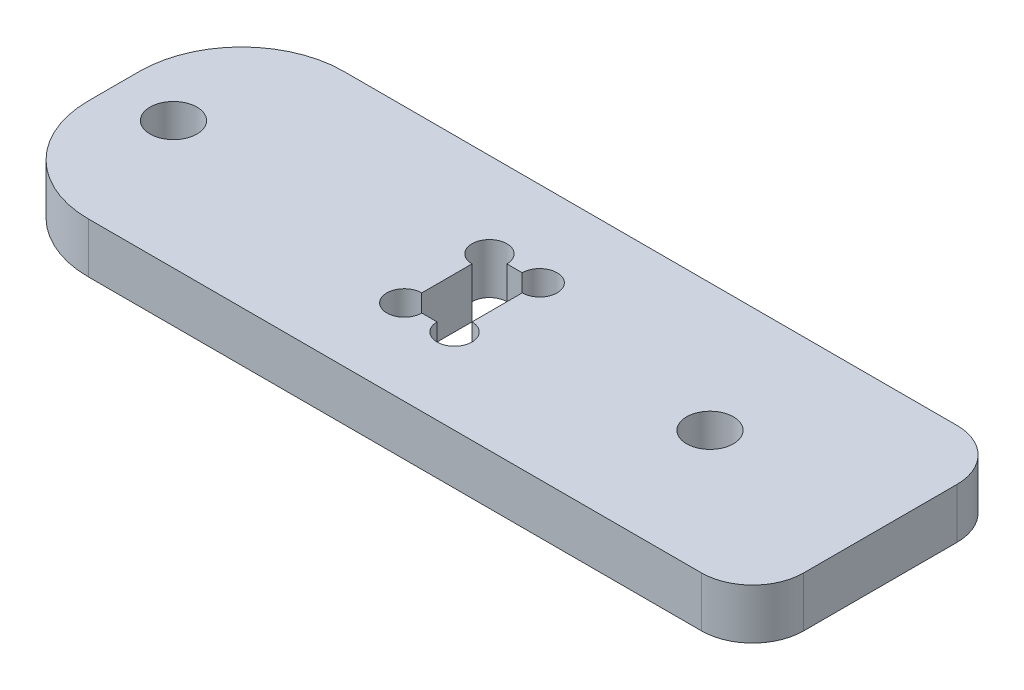
ISO-10303-21;
HEADER;
FILE_DESCRIPTION(('STEP AP214'),'2;1');
FILE_NAME('part.step','',(''),(''),'','','');
FILE_SCHEMA(('AUTOMOTIVE_DESIGN { 1 0 10303 214 1 1 1 1 }'));
ENDSEC;
DATA;
#1=APPLICATION_CONTEXT('core data for automotive mechanical design processes');
#2=APPLICATION_PROTOCOL_DEFINITION('international standard','automotive_design',2000,#1);
#3=PRODUCT_CONTEXT('',#1,'mechanical');
#4=PRODUCT('Part','Part','',(#3));
#5=PRODUCT_RELATED_PRODUCT_CATEGORY('part','',(#4));
#6=PRODUCT_DEFINITION_FORMATION('','',#4);
#7=PRODUCT_DEFINITION_CONTEXT('part definition',#1,'design');
#8=PRODUCT_DEFINITION('design','',#6,#7);
#9=PRODUCT_DEFINITION_SHAPE('','',#8);
#10=(LENGTH_UNIT() NAMED_UNIT(*) SI_UNIT(.MILLI.,.METRE.));
#11=(NAMED_UNIT(*) PLANE_ANGLE_UNIT() SI_UNIT($,.RADIAN.));
#12=(NAMED_UNIT(*) SI_UNIT($,.STERADIAN.) SOLID_ANGLE_UNIT());
#13=UNCERTAINTY_MEASURE_WITH_UNIT(LENGTH_MEASURE(1.E-05),#10,'distance_accuracy_value','');
#14=(GEOMETRIC_REPRESENTATION_CONTEXT(3) GLOBAL_UNCERTAINTY_ASSIGNED_CONTEXT((#13)) GLOBAL_UNIT_ASSIGNED_CONTEXT((#10,
#11,#12)) REPRESENTATION_CONTEXT('',''));
#15=CARTESIAN_POINT('',(0.,0.,0.));
#16=DIRECTION('',(0.,0.,1.));
#17=DIRECTION('',(1.,0.,0.));
#18=AXIS2_PLACEMENT_3D('',#15,#16,#17);
#19=CARTESIAN_POINT('',(45.,5.9,15.));
#20=DIRECTION('',(-1.,0.,0.));
#21=DIRECTION('',(0.,0.,1.));
#22=AXIS2_PLACEMENT_3D('',#19,#20,#21);
#23=PLANE('',#22);
#24=DIRECTION('',(0.,0.,-1.));
#25=VECTOR('',#24,1.);
#26=CARTESIAN_POINT('',(45.,0.,15.));
#27=LINE('',#26,#25);
#28=CARTESIAN_POINT('',(45.,0.,9.));
#29=VERTEX_POINT('',#28);
#30=CARTESIAN_POINT('',(45.,0.,-9.));
#31=VERTEX_POINT('',#30);
#32=EDGE_CURVE('E235',#29,#31,#27,.T.);
#33=ORIENTED_EDGE('',*,*,#32,.T.);
#34=DIRECTION('',(0.,-1.,0.));
#35=VECTOR('',#34,1.);
#36=CARTESIAN_POINT('',(45.,5.9,-9.));
#37=LINE('',#36,#35);
#38=CARTESIAN_POINT('',(45.,5.9,-9.));
#39=VERTEX_POINT('',#38);
#40=EDGE_CURVE('E202',#31,#39,#37,.F.);
#41=ORIENTED_EDGE('',*,*,#40,.T.);
#42=DIRECTION('',(0.,0.,-1.));
#43=VECTOR('',#42,1.);
#44=CARTESIAN_POINT('',(45.,5.9,15.));
#45=LINE('',#44,#43);
#46=CARTESIAN_POINT('',(45.,5.9,9.));
#47=VERTEX_POINT('',#46);
#48=EDGE_CURVE('E233',#47,#39,#45,.T.);
#49=ORIENTED_EDGE('',*,*,#48,.F.);
#50=DIRECTION('',(0.,-1.,0.));
#51=VECTOR('',#50,1.);
#52=CARTESIAN_POINT('',(45.,5.9,9.));
#53=LINE('',#52,#51);
#54=EDGE_CURVE('E199',#47,#29,#53,.T.);
#55=ORIENTED_EDGE('',*,*,#54,.T.);
#56=EDGE_LOOP('',(#33,#41,#49,#55));
#57=FACE_BOUND('',#56,.T.);
#58=ADVANCED_FACE('F38',(#57),#23,.F.);
#59=CARTESIAN_POINT('',(-45.,5.9,-15.));
#60=DIRECTION('',(0.,0.,1.));
#61=DIRECTION('',(1.,0.,0.));
#62=AXIS2_PLACEMENT_3D('',#59,#60,#61);
#63=PLANE('',#62);
#64=DIRECTION('',(-1.,0.,0.));
#65=VECTOR('',#64,1.);
#66=CARTESIAN_POINT('',(-45.,5.9,-15.));
#67=LINE('',#66,#65);
#68=CARTESIAN_POINT('',(39.,5.9,-15.));
#69=VERTEX_POINT('',#68);
#70=CARTESIAN_POINT('',(-33.,5.9,-15.));
#71=VERTEX_POINT('',#70);
#72=EDGE_CURVE('E253',#69,#71,#67,.T.);
#73=ORIENTED_EDGE('',*,*,#72,.F.);
#74=DIRECTION('',(0.,-1.,0.));
#75=VECTOR('',#74,1.);
#76=CARTESIAN_POINT('',(39.,5.9,-15.));
#77=LINE('',#76,#75);
#78=CARTESIAN_POINT('',(39.,0.,-15.));
#79=VERTEX_POINT('',#78);
#80=EDGE_CURVE('E188',#69,#79,#77,.T.);
#81=ORIENTED_EDGE('',*,*,#80,.T.);
#82=DIRECTION('',(-1.,0.,0.));
#83=VECTOR('',#82,1.);
#84=CARTESIAN_POINT('',(-45.,0.,-15.));
#85=LINE('',#84,#83);
#86=CARTESIAN_POINT('',(-33.,0.,-15.));
#87=VERTEX_POINT('',#86);
#88=EDGE_CURVE('E231',#79,#87,#85,.T.);
#89=ORIENTED_EDGE('',*,*,#88,.T.);
#90=DIRECTION('',(0.,-1.,0.));
#91=VECTOR('',#90,1.);
#92=CARTESIAN_POINT('',(-33.,5.9,-15.));
#93=LINE('',#92,#91);
#94=EDGE_CURVE('E181',#87,#71,#93,.F.);
#95=ORIENTED_EDGE('',*,*,#94,.T.);
#96=EDGE_LOOP('',(#73,#81,#89,#95));
#97=FACE_BOUND('',#96,.T.);
#98=ADVANCED_FACE('F271',(#97),#63,.F.);
#99=CARTESIAN_POINT('',(-45.,5.9,15.));
#100=DIRECTION('',(1.,0.,0.));
#101=DIRECTION('',(0.,0.,-1.));
#102=AXIS2_PLACEMENT_3D('',#99,#100,#101);
#103=PLANE('',#102);
#104=DIRECTION('',(0.,0.,1.));
#105=VECTOR('',#104,1.);
#106=CARTESIAN_POINT('',(-45.,0.,15.));
#107=LINE('',#106,#105);
#108=CARTESIAN_POINT('',(-45.,0.,-3.));
#109=VERTEX_POINT('',#108);
#110=CARTESIAN_POINT('',(-45.,0.,3.));
#111=VERTEX_POINT('',#110);
#112=EDGE_CURVE('E221',#109,#111,#107,.T.);
#113=ORIENTED_EDGE('',*,*,#112,.T.);
#114=DIRECTION('',(0.,-1.,0.));
#115=VECTOR('',#114,1.);
#116=CARTESIAN_POINT('',(-45.,5.9,3.));
#117=LINE('',#116,#115);
#118=CARTESIAN_POINT('',(-45.,5.9,3.));
#119=VERTEX_POINT('',#118);
#120=EDGE_CURVE('E12',#111,#119,#117,.F.);
#121=ORIENTED_EDGE('',*,*,#120,.T.);
#122=DIRECTION('',(0.,0.,1.));
#123=VECTOR('',#122,1.);
#124=CARTESIAN_POINT('',(-45.,5.9,15.));
#125=LINE('',#124,#123);
#126=CARTESIAN_POINT('',(-45.,5.9,-3.));
#127=VERTEX_POINT('',#126);
#128=EDGE_CURVE('E223',#127,#119,#125,.T.);
#129=ORIENTED_EDGE('',*,*,#128,.F.);
#130=DIRECTION('',(0.,-1.,0.));
#131=VECTOR('',#130,1.);
#132=CARTESIAN_POINT('',(-45.,5.9,-3.));
#133=LINE('',#132,#131);
#134=EDGE_CURVE('E46',#127,#109,#133,.T.);
#135=ORIENTED_EDGE('',*,*,#134,.T.);
#136=EDGE_LOOP('',(#113,#121,#129,#135));
#137=FACE_BOUND('',#136,.T.);
#138=ADVANCED_FACE('F220',(#137),#103,.F.);
#139=CARTESIAN_POINT('',(-45.,5.9,15.));
#140=DIRECTION('',(0.,0.,-1.));
#141=DIRECTION('',(-1.,0.,0.));
#142=AXIS2_PLACEMENT_3D('',#139,#140,#141);
#143=PLANE('',#142);
#144=DIRECTION('',(1.,0.,0.));
#145=VECTOR('',#144,1.);
#146=CARTESIAN_POINT('',(-45.,0.,15.));
#147=LINE('',#146,#145);
#148=CARTESIAN_POINT('',(-33.,0.,15.));
#149=VERTEX_POINT('',#148);
#150=CARTESIAN_POINT('',(39.,0.,15.));
#151=VERTEX_POINT('',#150);
#152=EDGE_CURVE('E230',#149,#151,#147,.T.);
#153=ORIENTED_EDGE('',*,*,#152,.T.);
#154=DIRECTION('',(0.,-1.,0.));
#155=VECTOR('',#154,1.);
#156=CARTESIAN_POINT('',(39.,5.9,15.));
#157=LINE('',#156,#155);
#158=CARTESIAN_POINT('',(39.,5.9,15.));
#159=VERTEX_POINT('',#158);
#160=EDGE_CURVE('E53',#151,#159,#157,.F.);
#161=ORIENTED_EDGE('',*,*,#160,.T.);
#162=DIRECTION('',(1.,0.,0.));
#163=VECTOR('',#162,1.);
#164=CARTESIAN_POINT('',(-45.,5.9,15.));
#165=LINE('',#164,#163);
#166=CARTESIAN_POINT('',(-33.,5.9,15.));
#167=VERTEX_POINT('',#166);
#168=EDGE_CURVE('E246',#167,#159,#165,.T.);
#169=ORIENTED_EDGE('',*,*,#168,.F.);
#170=DIRECTION('',(0.,-1.,0.));
#171=VECTOR('',#170,1.);
#172=CARTESIAN_POINT('',(-33.,5.9,15.));
#173=LINE('',#172,#171);
#174=EDGE_CURVE('E211',#167,#149,#173,.T.);
#175=ORIENTED_EDGE('',*,*,#174,.T.);
#176=EDGE_LOOP('',(#153,#161,#169,#175));
#177=FACE_BOUND('',#176,.T.);
#178=ADVANCED_FACE('F367',(#177),#143,.F.);
#179=CARTESIAN_POINT('',(0.,5.9,0.));
#180=DIRECTION('',(0.,-1.,0.));
#181=DIRECTION('',(0.,0.,-1.));
#182=AXIS2_PLACEMENT_3D('',#179,#180,#181);
#183=PLANE('',#182);
#184=DIRECTION('',(0.,0.,1.));
#185=VECTOR('',#184,1.);
#186=CARTESIAN_POINT('',(-5.9,5.9,-5.));
#187=LINE('',#186,#185);
#188=CARTESIAN_POINT('',(-5.9,5.9,-2.95));
#189=VERTEX_POINT('',#188);
#190=CARTESIAN_POINT('',(-5.9,5.9,2.95));
#191=VERTEX_POINT('',#190);
#192=EDGE_CURVE('E282',#189,#191,#187,.T.);
#193=ORIENTED_EDGE('',*,*,#192,.F.);
#194=CARTESIAN_POINT('',(-5.9,5.9,-5.));
#195=DIRECTION('',(0.,1.,0.));
#196=DIRECTION('',(0.,0.,1.));
#197=AXIS2_PLACEMENT_3D('',#194,#195,#196);
#198=CIRCLE('',#197,2.05);
#199=CARTESIAN_POINT('',(-3.85,5.9,-5.));
#200=VERTEX_POINT('',#199);
#201=EDGE_CURVE('E312',#200,#189,#198,.T.);
#202=ORIENTED_EDGE('',*,*,#201,.F.);
#203=DIRECTION('',(-1.,0.,0.));
#204=VECTOR('',#203,1.);
#205=CARTESIAN_POINT('',(-5.9,5.9,-5.));
#206=LINE('',#205,#204);
#207=CARTESIAN_POINT('',(-2.05,5.9,-5.));
#208=VERTEX_POINT('',#207);
#209=EDGE_CURVE('E285',#208,#200,#206,.T.);
#210=ORIENTED_EDGE('',*,*,#209,.F.);
#211=CARTESIAN_POINT('',(0.,5.9,-5.));
#212=DIRECTION('',(0.,1.,0.));
#213=DIRECTION('',(0.,0.,1.));
#214=AXIS2_PLACEMENT_3D('',#211,#212,#213);
#215=CIRCLE('',#214,2.05);
#216=CARTESIAN_POINT('',(0.,5.9,-2.95));
#217=VERTEX_POINT('',#216);
#218=EDGE_CURVE('E294',#217,#208,#215,.T.);
#219=ORIENTED_EDGE('',*,*,#218,.F.);
#220=DIRECTION('',(0.,0.,-1.));
#221=VECTOR('',#220,1.);
#222=CARTESIAN_POINT('',(0.,5.9,-5.));
#223=LINE('',#222,#221);
#224=CARTESIAN_POINT('',(0.,5.9,2.95));
#225=VERTEX_POINT('',#224);
#226=EDGE_CURVE('E288',#225,#217,#223,.T.);
#227=ORIENTED_EDGE('',*,*,#226,.F.);
#228=CARTESIAN_POINT('',(0.,5.9,5.));
#229=DIRECTION('',(0.,1.,0.));
#230=DIRECTION('',(0.,0.,1.));
#231=AXIS2_PLACEMENT_3D('',#228,#229,#230);
#232=CIRCLE('',#231,2.05);
#233=CARTESIAN_POINT('',(-2.05,5.9,5.));
#234=VERTEX_POINT('',#233);
#235=EDGE_CURVE('E305',#234,#225,#232,.T.);
#236=ORIENTED_EDGE('',*,*,#235,.F.);
#237=DIRECTION('',(1.,0.,0.));
#238=VECTOR('',#237,1.);
#239=CARTESIAN_POINT('',(-5.9,5.9,5.));
#240=LINE('',#239,#238);
#241=CARTESIAN_POINT('',(-3.85,5.9,5.));
#242=VERTEX_POINT('',#241);
#243=EDGE_CURVE('E278',#242,#234,#240,.T.);
#244=ORIENTED_EDGE('',*,*,#243,.F.);
#245=CARTESIAN_POINT('',(-5.9,5.9,5.));
#246=DIRECTION('',(0.,1.,0.));
#247=DIRECTION('',(0.,0.,1.));
#248=AXIS2_PLACEMENT_3D('',#245,#246,#247);
#249=CIRCLE('',#248,2.05);
#250=EDGE_CURVE('E157',#191,#242,#249,.T.);
#251=ORIENTED_EDGE('',*,*,#250,.F.);
#252=EDGE_LOOP('',(#193,#202,#210,#219,#227,#236,#244,#251));
#253=FACE_BOUND('',#252,.T.);
#254=CARTESIAN_POINT('',(25.,5.9,0.));
#255=DIRECTION('',(0.,1.,0.));
#256=DIRECTION('',(0.,0.,1.));
#257=AXIS2_PLACEMENT_3D('',#254,#255,#256);
#258=CIRCLE('',#257,2.75);
#259=CARTESIAN_POINT('',(25.,5.9,2.75));
#260=VERTEX_POINT('',#259);
#261=EDGE_CURVE('E243',#260,#260,#258,.T.);
#262=ORIENTED_EDGE('',*,*,#261,.F.);
#263=EDGE_LOOP('',(#262));
#264=FACE_BOUND('',#263,.T.);
#265=CARTESIAN_POINT('',(-38.,5.9,0.));
#266=DIRECTION('',(0.,1.,0.));
#267=DIRECTION('',(0.,0.,1.));
#268=AXIS2_PLACEMENT_3D('',#265,#266,#267);
#269=CIRCLE('',#268,2.75);
#270=CARTESIAN_POINT('',(-38.,5.9,2.75));
#271=VERTEX_POINT('',#270);
#272=EDGE_CURVE('E275',#271,#271,#269,.T.);
#273=ORIENTED_EDGE('',*,*,#272,.F.);
#274=EDGE_LOOP('',(#273));
#275=FACE_BOUND('',#274,.T.);
#276=ORIENTED_EDGE('',*,*,#48,.T.);
#277=CARTESIAN_POINT('',(39.,5.9,-9.));
#278=DIRECTION('',(0.,-1.,0.));
#279=DIRECTION('',(0.,0.,-1.));
#280=AXIS2_PLACEMENT_3D('',#277,#278,#279);
#281=CIRCLE('',#280,6.);
#282=EDGE_CURVE('E209',#39,#69,#281,.F.);
#283=ORIENTED_EDGE('',*,*,#282,.T.);
#284=ORIENTED_EDGE('',*,*,#72,.T.);
#285=CARTESIAN_POINT('',(-33.,5.9,-3.));
#286=DIRECTION('',(0.,-1.,0.));
#287=DIRECTION('',(0.,0.,-1.));
#288=AXIS2_PLACEMENT_3D('',#285,#286,#287);
#289=CIRCLE('',#288,12.);
#290=EDGE_CURVE('E204',#71,#127,#289,.F.);
#291=ORIENTED_EDGE('',*,*,#290,.T.);
#292=ORIENTED_EDGE('',*,*,#128,.T.);
#293=CARTESIAN_POINT('',(-33.,5.9,3.));
#294=DIRECTION('',(0.,-1.,0.));
#295=DIRECTION('',(0.,0.,-1.));
#296=AXIS2_PLACEMENT_3D('',#293,#294,#295);
#297=CIRCLE('',#296,12.);
#298=EDGE_CURVE('E60',#119,#167,#297,.F.);
#299=ORIENTED_EDGE('',*,*,#298,.T.);
#300=ORIENTED_EDGE('',*,*,#168,.T.);
#301=CARTESIAN_POINT('',(39.,5.9,9.));
#302=DIRECTION('',(0.,-1.,0.));
#303=DIRECTION('',(0.,0.,-1.));
#304=AXIS2_PLACEMENT_3D('',#301,#302,#303);
#305=CIRCLE('',#304,6.);
#306=EDGE_CURVE('E207',#159,#47,#305,.F.);
#307=ORIENTED_EDGE('',*,*,#306,.T.);
#308=EDGE_LOOP('',(#276,#283,#284,#291,#292,#299,#300,#307));
#309=FACE_BOUND('',#308,.T.);
#310=ADVANCED_FACE('F269',(#253,#264,#275,#309),#183,.F.);
#311=CARTESIAN_POINT('',(0.,0.,0.));
#312=DIRECTION('',(0.,-1.,0.));
#313=DIRECTION('',(0.,0.,-1.));
#314=AXIS2_PLACEMENT_3D('',#311,#312,#313);
#315=PLANE('',#314);
#316=CARTESIAN_POINT('',(-5.9,0.,-5.));
#317=DIRECTION('',(0.,-1.,0.));
#318=DIRECTION('',(0.,0.,-1.));
#319=AXIS2_PLACEMENT_3D('',#316,#317,#318);
#320=CIRCLE('',#319,2.05);
#321=CARTESIAN_POINT('',(-3.85,0.,-5.));
#322=VERTEX_POINT('',#321);
#323=CARTESIAN_POINT('',(-5.9,0.,-2.95));
#324=VERTEX_POINT('',#323);
#325=EDGE_CURVE('E302',#322,#324,#320,.F.);
#326=ORIENTED_EDGE('',*,*,#325,.T.);
#327=DIRECTION('',(0.,0.,-1.));
#328=VECTOR('',#327,1.);
#329=CARTESIAN_POINT('',(-5.9,0.,0.));
#330=LINE('',#329,#328);
#331=CARTESIAN_POINT('',(-5.9,0.,2.95));
#332=VERTEX_POINT('',#331);
#333=EDGE_CURVE('E173',#332,#324,#330,.T.);
#334=ORIENTED_EDGE('',*,*,#333,.F.);
#335=CARTESIAN_POINT('',(-5.9,0.,5.));
#336=DIRECTION('',(0.,-1.,0.));
#337=DIRECTION('',(0.,0.,-1.));
#338=AXIS2_PLACEMENT_3D('',#335,#336,#337);
#339=CIRCLE('',#338,2.05);
#340=CARTESIAN_POINT('',(-3.85,0.,5.));
#341=VERTEX_POINT('',#340);
#342=EDGE_CURVE('E154',#332,#341,#339,.F.);
#343=ORIENTED_EDGE('',*,*,#342,.T.);
#344=DIRECTION('',(-1.,0.,0.));
#345=VECTOR('',#344,1.);
#346=CARTESIAN_POINT('',(0.,0.,5.));
#347=LINE('',#346,#345);
#348=CARTESIAN_POINT('',(-2.05,0.,5.));
#349=VERTEX_POINT('',#348);
#350=EDGE_CURVE('E171',#349,#341,#347,.T.);
#351=ORIENTED_EDGE('',*,*,#350,.F.);
#352=CARTESIAN_POINT('',(0.,0.,5.));
#353=DIRECTION('',(0.,-1.,0.));
#354=DIRECTION('',(0.,0.,-1.));
#355=AXIS2_PLACEMENT_3D('',#352,#353,#354);
#356=CIRCLE('',#355,2.05);
#357=CARTESIAN_POINT('',(0.,0.,2.95));
#358=VERTEX_POINT('',#357);
#359=EDGE_CURVE('E307',#349,#358,#356,.F.);
#360=ORIENTED_EDGE('',*,*,#359,.T.);
#361=DIRECTION('',(0.,0.,1.));
#362=VECTOR('',#361,1.);
#363=CARTESIAN_POINT('',(0.,0.,0.));
#364=LINE('',#363,#362);
#365=CARTESIAN_POINT('',(0.,0.,-2.95));
#366=VERTEX_POINT('',#365);
#367=EDGE_CURVE('E178',#366,#358,#364,.T.);
#368=ORIENTED_EDGE('',*,*,#367,.F.);
#369=CARTESIAN_POINT('',(0.,0.,-5.));
#370=DIRECTION('',(0.,-1.,0.));
#371=DIRECTION('',(0.,0.,-1.));
#372=AXIS2_PLACEMENT_3D('',#369,#370,#371);
#373=CIRCLE('',#372,2.05);
#374=CARTESIAN_POINT('',(-2.05,0.,-5.));
#375=VERTEX_POINT('',#374);
#376=EDGE_CURVE('E291',#366,#375,#373,.F.);
#377=ORIENTED_EDGE('',*,*,#376,.T.);
#378=DIRECTION('',(1.,0.,0.));
#379=VECTOR('',#378,1.);
#380=CARTESIAN_POINT('',(0.,0.,-5.));
#381=LINE('',#380,#379);
#382=EDGE_CURVE('E183',#322,#375,#381,.T.);
#383=ORIENTED_EDGE('',*,*,#382,.F.);
#384=EDGE_LOOP('',(#326,#334,#343,#351,#360,#368,#377,#383));
#385=FACE_BOUND('',#384,.T.);
#386=CARTESIAN_POINT('',(25.,0.,0.));
#387=DIRECTION('',(0.,-1.,0.));
#388=DIRECTION('',(0.,0.,-1.));
#389=AXIS2_PLACEMENT_3D('',#386,#387,#388);
#390=CIRCLE('',#389,2.75);
#391=CARTESIAN_POINT('',(25.,0.,-2.75));
#392=VERTEX_POINT('',#391);
#393=EDGE_CURVE('E242',#392,#392,#390,.T.);
#394=ORIENTED_EDGE('',*,*,#393,.F.);
#395=EDGE_LOOP('',(#394));
#396=FACE_BOUND('',#395,.T.);
#397=CARTESIAN_POINT('',(-38.,0.,0.));
#398=DIRECTION('',(0.,-1.,0.));
#399=DIRECTION('',(0.,0.,-1.));
#400=AXIS2_PLACEMENT_3D('',#397,#398,#399);
#401=CIRCLE('',#400,2.75);
#402=CARTESIAN_POINT('',(-38.,0.,-2.75));
#403=VERTEX_POINT('',#402);
#404=EDGE_CURVE('E239',#403,#403,#401,.T.);
#405=ORIENTED_EDGE('',*,*,#404,.F.);
#406=EDGE_LOOP('',(#405));
#407=FACE_BOUND('',#406,.T.);
#408=ORIENTED_EDGE('',*,*,#88,.F.);
#409=CARTESIAN_POINT('',(39.,0.,-9.));
#410=DIRECTION('',(0.,-1.,0.));
#411=DIRECTION('',(0.,0.,-1.));
#412=AXIS2_PLACEMENT_3D('',#409,#410,#411);
#413=CIRCLE('',#412,6.);
#414=EDGE_CURVE('E197',#79,#31,#413,.T.);
#415=ORIENTED_EDGE('',*,*,#414,.T.);
#416=ORIENTED_EDGE('',*,*,#32,.F.);
#417=CARTESIAN_POINT('',(39.,0.,9.));
#418=DIRECTION('',(0.,-1.,0.));
#419=DIRECTION('',(0.,0.,-1.));
#420=AXIS2_PLACEMENT_3D('',#417,#418,#419);
#421=CIRCLE('',#420,6.);
#422=EDGE_CURVE('E195',#29,#151,#421,.T.);
#423=ORIENTED_EDGE('',*,*,#422,.T.);
#424=ORIENTED_EDGE('',*,*,#152,.F.);
#425=CARTESIAN_POINT('',(-33.,0.,3.));
#426=DIRECTION('',(0.,-1.,0.));
#427=DIRECTION('',(0.,0.,-1.));
#428=AXIS2_PLACEMENT_3D('',#425,#426,#427);
#429=CIRCLE('',#428,12.);
#430=EDGE_CURVE('E193',#149,#111,#429,.T.);
#431=ORIENTED_EDGE('',*,*,#430,.T.);
#432=ORIENTED_EDGE('',*,*,#112,.F.);
#433=CARTESIAN_POINT('',(-33.,0.,-3.));
#434=DIRECTION('',(0.,-1.,0.));
#435=DIRECTION('',(0.,0.,-1.));
#436=AXIS2_PLACEMENT_3D('',#433,#434,#435);
#437=CIRCLE('',#436,12.);
#438=EDGE_CURVE('E191',#109,#87,#437,.T.);
#439=ORIENTED_EDGE('',*,*,#438,.T.);
#440=EDGE_LOOP('',(#408,#415,#416,#423,#424,#431,#432,#439));
#441=FACE_BOUND('',#440,.T.);
#442=ADVANCED_FACE('F168',(#385,#396,#407,#441),#315,.T.);
#443=CARTESIAN_POINT('',(-38.,-4.1,0.));
#444=DIRECTION('',(0.,1.,0.));
#445=DIRECTION('',(0.,0.,1.));
#446=AXIS2_PLACEMENT_3D('',#443,#444,#445);
#447=CYLINDRICAL_SURFACE('',#446,2.75);
#448=ORIENTED_EDGE('',*,*,#404,.T.);
#449=EDGE_LOOP('',(#448));
#450=FACE_BOUND('',#449,.T.);
#451=ORIENTED_EDGE('',*,*,#272,.T.);
#452=EDGE_LOOP('',(#451));
#453=FACE_BOUND('',#452,.T.);
#454=ADVANCED_FACE('F377',(#450,#453),#447,.F.);
#455=CARTESIAN_POINT('',(25.,-4.1,0.));
#456=DIRECTION('',(0.,1.,0.));
#457=DIRECTION('',(0.,0.,1.));
#458=AXIS2_PLACEMENT_3D('',#455,#456,#457);
#459=CYLINDRICAL_SURFACE('',#458,2.75);
#460=ORIENTED_EDGE('',*,*,#393,.T.);
#461=EDGE_LOOP('',(#460));
#462=FACE_BOUND('',#461,.T.);
#463=ORIENTED_EDGE('',*,*,#261,.T.);
#464=EDGE_LOOP('',(#463));
#465=FACE_BOUND('',#464,.T.);
#466=ADVANCED_FACE('F381',(#462,#465),#459,.F.);
#467=CARTESIAN_POINT('',(0.,-4.1,-5.));
#468=DIRECTION('',(1.,0.,0.));
#469=DIRECTION('',(0.,0.,-1.));
#470=AXIS2_PLACEMENT_3D('',#467,#468,#469);
#471=PLANE('',#470);
#472=ORIENTED_EDGE('',*,*,#367,.T.);
#473=DIRECTION('',(0.,1.,0.));
#474=VECTOR('',#473,1.);
#475=CARTESIAN_POINT('',(0.,-0.00100000000000013,2.95));
#476=LINE('',#475,#474);
#477=EDGE_CURVE('E303',#225,#358,#476,.F.);
#478=ORIENTED_EDGE('',*,*,#477,.F.);
#479=ORIENTED_EDGE('',*,*,#226,.T.);
#480=DIRECTION('',(0.,1.,0.));
#481=VECTOR('',#480,1.);
#482=CARTESIAN_POINT('',(0.,-0.00100000000000013,-2.95));
#483=LINE('',#482,#481);
#484=EDGE_CURVE('E296',#366,#217,#483,.T.);
#485=ORIENTED_EDGE('',*,*,#484,.F.);
#486=EDGE_LOOP('',(#472,#478,#479,#485));
#487=FACE_BOUND('',#486,.T.);
#488=ADVANCED_FACE('F332',(#487),#471,.F.);
#489=CARTESIAN_POINT('',(-5.9,-4.1,5.));
#490=DIRECTION('',(0.,0.,1.));
#491=DIRECTION('',(1.,0.,0.));
#492=AXIS2_PLACEMENT_3D('',#489,#490,#491);
#493=PLANE('',#492);
#494=ORIENTED_EDGE('',*,*,#243,.T.);
#495=DIRECTION('',(0.,1.,0.));
#496=VECTOR('',#495,1.);
#497=CARTESIAN_POINT('',(-2.05,-0.00100000000000013,5.));
#498=LINE('',#497,#496);
#499=EDGE_CURVE('E177',#349,#234,#498,.T.);
#500=ORIENTED_EDGE('',*,*,#499,.F.);
#501=ORIENTED_EDGE('',*,*,#350,.T.);
#502=DIRECTION('',(0.,1.,0.));
#503=VECTOR('',#502,1.);
#504=CARTESIAN_POINT('',(-3.85,-0.00100000000000013,5.));
#505=LINE('',#504,#503);
#506=EDGE_CURVE('E151',#242,#341,#505,.F.);
#507=ORIENTED_EDGE('',*,*,#506,.F.);
#508=EDGE_LOOP('',(#494,#500,#501,#507));
#509=FACE_BOUND('',#508,.T.);
#510=ADVANCED_FACE('F176',(#509),#493,.F.);
#511=CARTESIAN_POINT('',(-5.9,-4.1,-5.));
#512=DIRECTION('',(-1.,0.,0.));
#513=DIRECTION('',(0.,0.,1.));
#514=AXIS2_PLACEMENT_3D('',#511,#512,#513);
#515=PLANE('',#514);
#516=ORIENTED_EDGE('',*,*,#333,.T.);
#517=DIRECTION('',(0.,1.,0.));
#518=VECTOR('',#517,1.);
#519=CARTESIAN_POINT('',(-5.9,-0.00100000000000013,-2.95));
#520=LINE('',#519,#518);
#521=EDGE_CURVE('E310',#189,#324,#520,.F.);
#522=ORIENTED_EDGE('',*,*,#521,.F.);
#523=ORIENTED_EDGE('',*,*,#192,.T.);
#524=DIRECTION('',(0.,1.,0.));
#525=VECTOR('',#524,1.);
#526=CARTESIAN_POINT('',(-5.9,-0.00100000000000013,2.95));
#527=LINE('',#526,#525);
#528=EDGE_CURVE('E162',#332,#191,#527,.T.);
#529=ORIENTED_EDGE('',*,*,#528,.F.);
#530=EDGE_LOOP('',(#516,#522,#523,#529));
#531=FACE_BOUND('',#530,.T.);
#532=ADVANCED_FACE('F323',(#531),#515,.F.);
#533=CARTESIAN_POINT('',(-5.9,-4.1,-5.));
#534=DIRECTION('',(0.,0.,-1.));
#535=DIRECTION('',(-1.,0.,0.));
#536=AXIS2_PLACEMENT_3D('',#533,#534,#535);
#537=PLANE('',#536);
#538=ORIENTED_EDGE('',*,*,#209,.T.);
#539=DIRECTION('',(0.,1.,0.));
#540=VECTOR('',#539,1.);
#541=CARTESIAN_POINT('',(-3.85,-0.00100000000000013,-5.));
#542=LINE('',#541,#540);
#543=EDGE_CURVE('E300',#322,#200,#542,.T.);
#544=ORIENTED_EDGE('',*,*,#543,.F.);
#545=ORIENTED_EDGE('',*,*,#382,.T.);
#546=DIRECTION('',(0.,1.,0.));
#547=VECTOR('',#546,1.);
#548=CARTESIAN_POINT('',(-2.05,-0.00100000000000013,-5.));
#549=LINE('',#548,#547);
#550=EDGE_CURVE('E298',#208,#375,#549,.F.);
#551=ORIENTED_EDGE('',*,*,#550,.F.);
#552=EDGE_LOOP('',(#538,#544,#545,#551));
#553=FACE_BOUND('',#552,.T.);
#554=ADVANCED_FACE('F336',(#553),#537,.F.);
#555=CARTESIAN_POINT('',(0.,-0.00100000000000013,-5.));
#556=DIRECTION('',(0.,1.,0.));
#557=DIRECTION('',(0.,0.,1.));
#558=AXIS2_PLACEMENT_3D('',#555,#556,#557);
#559=CYLINDRICAL_SURFACE('',#558,2.05);
#560=ORIENTED_EDGE('',*,*,#484,.T.);
#561=ORIENTED_EDGE('',*,*,#218,.T.);
#562=ORIENTED_EDGE('',*,*,#550,.T.);
#563=ORIENTED_EDGE('',*,*,#376,.F.);
#564=EDGE_LOOP('',(#560,#561,#562,#563));
#565=FACE_BOUND('',#564,.T.);
#566=ADVANCED_FACE('F329',(#565),#559,.F.);
#567=CARTESIAN_POINT('',(-5.9,-0.00100000000000013,-5.));
#568=DIRECTION('',(0.,1.,0.));
#569=DIRECTION('',(0.,0.,1.));
#570=AXIS2_PLACEMENT_3D('',#567,#568,#569);
#571=CYLINDRICAL_SURFACE('',#570,2.05);
#572=ORIENTED_EDGE('',*,*,#521,.T.);
#573=ORIENTED_EDGE('',*,*,#325,.F.);
#574=ORIENTED_EDGE('',*,*,#543,.T.);
#575=ORIENTED_EDGE('',*,*,#201,.T.);
#576=EDGE_LOOP('',(#572,#573,#574,#575));
#577=FACE_BOUND('',#576,.T.);
#578=ADVANCED_FACE('F325',(#577),#571,.F.);
#579=CARTESIAN_POINT('',(-5.9,-0.00100000000000013,5.));
#580=DIRECTION('',(0.,1.,0.));
#581=DIRECTION('',(0.,0.,1.));
#582=AXIS2_PLACEMENT_3D('',#579,#580,#581);
#583=CYLINDRICAL_SURFACE('',#582,2.05);
#584=ORIENTED_EDGE('',*,*,#506,.T.);
#585=ORIENTED_EDGE('',*,*,#342,.F.);
#586=ORIENTED_EDGE('',*,*,#528,.T.);
#587=ORIENTED_EDGE('',*,*,#250,.T.);
#588=EDGE_LOOP('',(#584,#585,#586,#587));
#589=FACE_BOUND('',#588,.T.);
#590=ADVANCED_FACE('F153',(#589),#583,.F.);
#591=CARTESIAN_POINT('',(0.,-0.00100000000000013,5.));
#592=DIRECTION('',(0.,1.,0.));
#593=DIRECTION('',(0.,0.,1.));
#594=AXIS2_PLACEMENT_3D('',#591,#592,#593);
#595=CYLINDRICAL_SURFACE('',#594,2.05);
#596=ORIENTED_EDGE('',*,*,#477,.T.);
#597=ORIENTED_EDGE('',*,*,#359,.F.);
#598=ORIENTED_EDGE('',*,*,#499,.T.);
#599=ORIENTED_EDGE('',*,*,#235,.T.);
#600=EDGE_LOOP('',(#596,#597,#598,#599));
#601=FACE_BOUND('',#600,.T.);
#602=ADVANCED_FACE('F357',(#601),#595,.F.);
#603=CARTESIAN_POINT('',(39.,5.9,-9.));
#604=DIRECTION('',(0.,-1.,0.));
#605=DIRECTION('',(0.,0.,-1.));
#606=AXIS2_PLACEMENT_3D('',#603,#604,#605);
#607=CYLINDRICAL_SURFACE('',#606,6.);
#608=ORIENTED_EDGE('',*,*,#282,.F.);
#609=ORIENTED_EDGE('',*,*,#40,.F.);
#610=ORIENTED_EDGE('',*,*,#414,.F.);
#611=ORIENTED_EDGE('',*,*,#80,.F.);
#612=EDGE_LOOP('',(#608,#609,#610,#611));
#613=FACE_BOUND('',#612,.T.);
#614=ADVANCED_FACE('F265',(#613),#607,.T.);
#615=CARTESIAN_POINT('',(39.,5.9,9.));
#616=DIRECTION('',(0.,-1.,0.));
#617=DIRECTION('',(0.,0.,-1.));
#618=AXIS2_PLACEMENT_3D('',#615,#616,#617);
#619=CYLINDRICAL_SURFACE('',#618,6.);
#620=ORIENTED_EDGE('',*,*,#306,.F.);
#621=ORIENTED_EDGE('',*,*,#160,.F.);
#622=ORIENTED_EDGE('',*,*,#422,.F.);
#623=ORIENTED_EDGE('',*,*,#54,.F.);
#624=EDGE_LOOP('',(#620,#621,#622,#623));
#625=FACE_BOUND('',#624,.T.);
#626=ADVANCED_FACE('F356',(#625),#619,.T.);
#627=CARTESIAN_POINT('',(-33.,5.9,3.));
#628=DIRECTION('',(0.,-1.,0.));
#629=DIRECTION('',(0.,0.,-1.));
#630=AXIS2_PLACEMENT_3D('',#627,#628,#629);
#631=CYLINDRICAL_SURFACE('',#630,12.);
#632=ORIENTED_EDGE('',*,*,#298,.F.);
#633=ORIENTED_EDGE('',*,*,#120,.F.);
#634=ORIENTED_EDGE('',*,*,#430,.F.);
#635=ORIENTED_EDGE('',*,*,#174,.F.);
#636=EDGE_LOOP('',(#632,#633,#634,#635));
#637=FACE_BOUND('',#636,.T.);
#638=ADVANCED_FACE('F359',(#637),#631,.T.);
#639=CARTESIAN_POINT('',(-33.,5.9,-3.));
#640=DIRECTION('',(0.,-1.,0.));
#641=DIRECTION('',(0.,0.,-1.));
#642=AXIS2_PLACEMENT_3D('',#639,#640,#641);
#643=CYLINDRICAL_SURFACE('',#642,12.);
#644=ORIENTED_EDGE('',*,*,#290,.F.);
#645=ORIENTED_EDGE('',*,*,#94,.F.);
#646=ORIENTED_EDGE('',*,*,#438,.F.);
#647=ORIENTED_EDGE('',*,*,#134,.F.);
#648=EDGE_LOOP('',(#644,#645,#646,#647));
#649=FACE_BOUND('',#648,.T.);
#650=ADVANCED_FACE('F40',(#649),#643,.T.);
#651=CLOSED_SHELL('',(#58,#98,#138,#178,#310,#442,#454,#466,#488,#510,#532,#554,#566,#578,#590,
#602,#614,#626,#638,#650));
#652=MANIFOLD_SOLID_BREP('B2',#651);
#653=ADVANCED_BREP_SHAPE_REPRESENTATION('',(#18,#652),#14);
#654=SHAPE_DEFINITION_REPRESENTATION(#9,#653);
ENDSEC;
END-ISO-10303-21;
